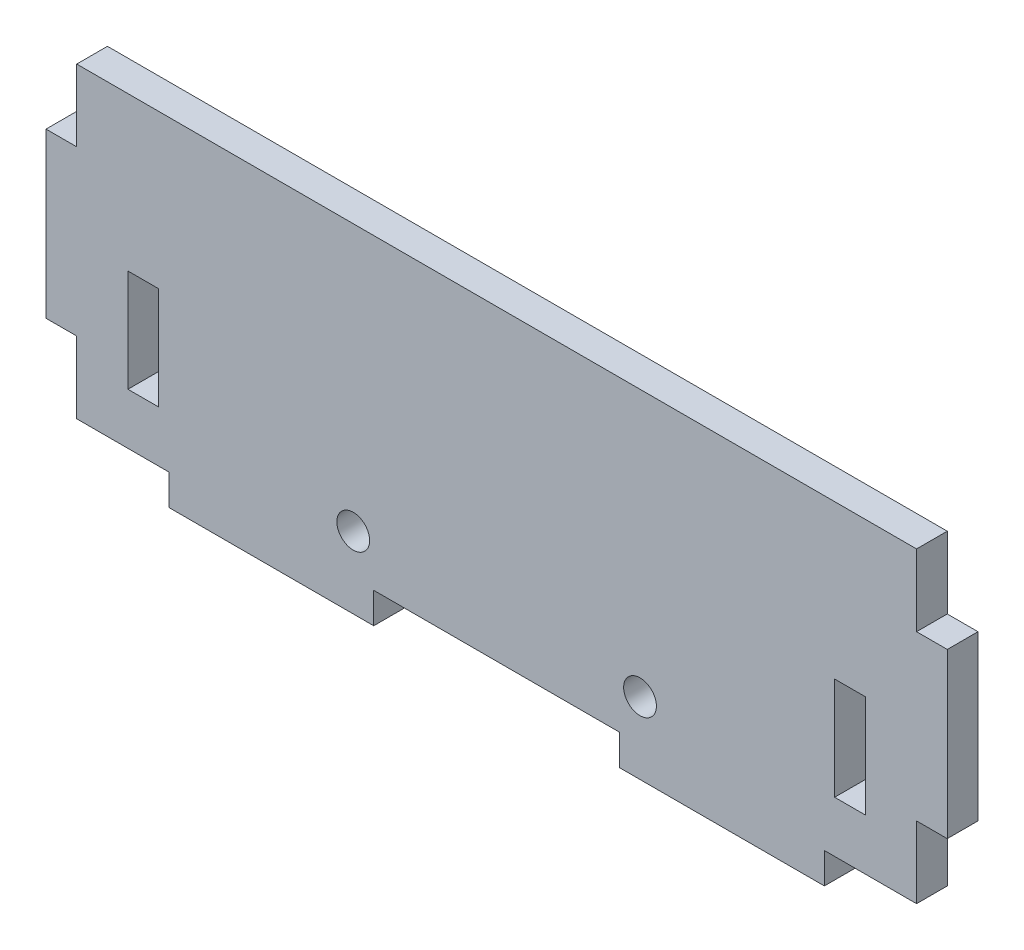
ISO-10303-21;
HEADER;
FILE_DESCRIPTION(('STEP AP214'),'2;1');
FILE_NAME('part.step','',(''),(''),'','','');
FILE_SCHEMA(('AUTOMOTIVE_DESIGN { 1 0 10303 214 1 1 1 1 }'));
ENDSEC;
DATA;
#1=APPLICATION_CONTEXT('core data for automotive mechanical design processes');
#2=APPLICATION_PROTOCOL_DEFINITION('international standard','automotive_design',2000,#1);
#3=PRODUCT_CONTEXT('',#1,'mechanical');
#4=PRODUCT('Part','Part','',(#3));
#5=PRODUCT_RELATED_PRODUCT_CATEGORY('part','',(#4));
#6=PRODUCT_DEFINITION_FORMATION('','',#4);
#7=PRODUCT_DEFINITION_CONTEXT('part definition',#1,'design');
#8=PRODUCT_DEFINITION('design','',#6,#7);
#9=PRODUCT_DEFINITION_SHAPE('','',#8);
#10=(LENGTH_UNIT() NAMED_UNIT(*) SI_UNIT(.MILLI.,.METRE.));
#11=(NAMED_UNIT(*) PLANE_ANGLE_UNIT() SI_UNIT($,.RADIAN.));
#12=(NAMED_UNIT(*) SI_UNIT($,.STERADIAN.) SOLID_ANGLE_UNIT());
#13=UNCERTAINTY_MEASURE_WITH_UNIT(LENGTH_MEASURE(1.E-05),#10,'distance_accuracy_value','');
#14=(GEOMETRIC_REPRESENTATION_CONTEXT(3) GLOBAL_UNCERTAINTY_ASSIGNED_CONTEXT((#13)) GLOBAL_UNIT_ASSIGNED_CONTEXT((#10,
#11,#12)) REPRESENTATION_CONTEXT('',''));
#15=CARTESIAN_POINT('',(0.,0.,0.));
#16=DIRECTION('',(0.,0.,1.));
#17=DIRECTION('',(1.,0.,0.));
#18=AXIS2_PLACEMENT_3D('',#15,#16,#17);
#19=CARTESIAN_POINT('',(8.,0.,3.));
#20=DIRECTION('',(1.,0.,0.));
#21=DIRECTION('',(0.,0.,-1.));
#22=AXIS2_PLACEMENT_3D('',#19,#20,#21);
#23=PLANE('',#22);
#24=DIRECTION('',(0.,-1.,0.));
#25=VECTOR('',#24,1.);
#26=CARTESIAN_POINT('',(8.,0.,0.));
#27=LINE('',#26,#25);
#28=CARTESIAN_POINT('',(8.,15.,0.));
#29=VERTEX_POINT('',#28);
#30=CARTESIAN_POINT('',(8.,5.,0.));
#31=VERTEX_POINT('',#30);
#32=EDGE_CURVE('E395',#29,#31,#27,.T.);
#33=ORIENTED_EDGE('',*,*,#32,.F.);
#34=DIRECTION('',(0.,0.,-1.));
#35=VECTOR('',#34,1.);
#36=CARTESIAN_POINT('',(8.,15.,3.));
#37=LINE('',#36,#35);
#38=CARTESIAN_POINT('',(8.,15.,3.));
#39=VERTEX_POINT('',#38);
#40=EDGE_CURVE('E11',#39,#29,#37,.T.);
#41=ORIENTED_EDGE('',*,*,#40,.F.);
#42=DIRECTION('',(0.,-1.,0.));
#43=VECTOR('',#42,1.);
#44=CARTESIAN_POINT('',(8.,0.,3.));
#45=LINE('',#44,#43);
#46=CARTESIAN_POINT('',(8.,5.,3.));
#47=VERTEX_POINT('',#46);
#48=EDGE_CURVE('E241',#39,#47,#45,.T.);
#49=ORIENTED_EDGE('',*,*,#48,.T.);
#50=DIRECTION('',(0.,0.,-1.));
#51=VECTOR('',#50,1.);
#52=CARTESIAN_POINT('',(8.,5.,3.));
#53=LINE('',#52,#51);
#54=EDGE_CURVE('E54',#47,#31,#53,.T.);
#55=ORIENTED_EDGE('',*,*,#54,.T.);
#56=EDGE_LOOP('',(#33,#41,#49,#55));
#57=FACE_BOUND('',#56,.T.);
#58=ADVANCED_FACE('F35',(#57),#23,.T.);
#59=CARTESIAN_POINT('',(0.,15.,3.));
#60=DIRECTION('',(0.,1.,0.));
#61=DIRECTION('',(0.,0.,1.));
#62=AXIS2_PLACEMENT_3D('',#59,#60,#61);
#63=PLANE('',#62);
#64=DIRECTION('',(1.,0.,0.));
#65=VECTOR('',#64,1.);
#66=CARTESIAN_POINT('',(0.,15.,0.));
#67=LINE('',#66,#65);
#68=CARTESIAN_POINT('',(11.,15.,0.));
#69=VERTEX_POINT('',#68);
#70=EDGE_CURVE('E246',#29,#69,#67,.T.);
#71=ORIENTED_EDGE('',*,*,#70,.T.);
#72=DIRECTION('',(0.,0.,-1.));
#73=VECTOR('',#72,1.);
#74=CARTESIAN_POINT('',(11.,15.,3.));
#75=LINE('',#74,#73);
#76=CARTESIAN_POINT('',(11.,15.,3.));
#77=VERTEX_POINT('',#76);
#78=EDGE_CURVE('E45',#77,#69,#75,.T.);
#79=ORIENTED_EDGE('',*,*,#78,.F.);
#80=DIRECTION('',(1.,0.,0.));
#81=VECTOR('',#80,1.);
#82=CARTESIAN_POINT('',(0.,15.,3.));
#83=LINE('',#82,#81);
#84=EDGE_CURVE('E235',#39,#77,#83,.T.);
#85=ORIENTED_EDGE('',*,*,#84,.F.);
#86=ORIENTED_EDGE('',*,*,#40,.T.);
#87=EDGE_LOOP('',(#71,#79,#85,#86));
#88=FACE_BOUND('',#87,.T.);
#89=ADVANCED_FACE('F244',(#88),#63,.F.);
#90=CARTESIAN_POINT('',(11.,0.,3.));
#91=DIRECTION('',(1.,0.,0.));
#92=DIRECTION('',(0.,0.,-1.));
#93=AXIS2_PLACEMENT_3D('',#90,#91,#92);
#94=PLANE('',#93);
#95=DIRECTION('',(0.,-1.,0.));
#96=VECTOR('',#95,1.);
#97=CARTESIAN_POINT('',(11.,0.,0.));
#98=LINE('',#97,#96);
#99=CARTESIAN_POINT('',(11.,5.,0.));
#100=VERTEX_POINT('',#99);
#101=EDGE_CURVE('E398',#69,#100,#98,.T.);
#102=ORIENTED_EDGE('',*,*,#101,.T.);
#103=DIRECTION('',(0.,0.,-1.));
#104=VECTOR('',#103,1.);
#105=CARTESIAN_POINT('',(11.,5.,3.));
#106=LINE('',#105,#104);
#107=CARTESIAN_POINT('',(11.,5.,3.));
#108=VERTEX_POINT('',#107);
#109=EDGE_CURVE('E140',#108,#100,#106,.T.);
#110=ORIENTED_EDGE('',*,*,#109,.F.);
#111=DIRECTION('',(0.,-1.,0.));
#112=VECTOR('',#111,1.);
#113=CARTESIAN_POINT('',(11.,0.,3.));
#114=LINE('',#113,#112);
#115=EDGE_CURVE('E227',#77,#108,#114,.T.);
#116=ORIENTED_EDGE('',*,*,#115,.F.);
#117=ORIENTED_EDGE('',*,*,#78,.T.);
#118=EDGE_LOOP('',(#102,#110,#116,#117));
#119=FACE_BOUND('',#118,.T.);
#120=ADVANCED_FACE('F229',(#119),#94,.F.);
#121=CARTESIAN_POINT('',(3.,0.,3.));
#122=DIRECTION('',(-1.,0.,0.));
#123=DIRECTION('',(0.,0.,1.));
#124=AXIS2_PLACEMENT_3D('',#121,#122,#123);
#125=PLANE('',#124);
#126=DIRECTION('',(0.,1.,0.));
#127=VECTOR('',#126,1.);
#128=CARTESIAN_POINT('',(3.,0.,0.));
#129=LINE('',#128,#127);
#130=CARTESIAN_POINT('',(3.,23.,0.));
#131=VERTEX_POINT('',#130);
#132=CARTESIAN_POINT('',(3.,30.,0.));
#133=VERTEX_POINT('',#132);
#134=EDGE_CURVE('E335',#131,#133,#129,.T.);
#135=ORIENTED_EDGE('',*,*,#134,.F.);
#136=DIRECTION('',(0.,0.,-1.));
#137=VECTOR('',#136,1.);
#138=CARTESIAN_POINT('',(3.,23.,3.));
#139=LINE('',#138,#137);
#140=CARTESIAN_POINT('',(3.,23.,3.));
#141=VERTEX_POINT('',#140);
#142=EDGE_CURVE('E297',#141,#131,#139,.T.);
#143=ORIENTED_EDGE('',*,*,#142,.F.);
#144=DIRECTION('',(0.,1.,0.));
#145=VECTOR('',#144,1.);
#146=CARTESIAN_POINT('',(3.,0.,3.));
#147=LINE('',#146,#145);
#148=CARTESIAN_POINT('',(3.,30.,3.));
#149=VERTEX_POINT('',#148);
#150=EDGE_CURVE('E421',#141,#149,#147,.T.);
#151=ORIENTED_EDGE('',*,*,#150,.T.);
#152=DIRECTION('',(0.,0.,-1.));
#153=VECTOR('',#152,1.);
#154=CARTESIAN_POINT('',(3.,30.,3.));
#155=LINE('',#154,#153);
#156=EDGE_CURVE('E251',#149,#133,#155,.T.);
#157=ORIENTED_EDGE('',*,*,#156,.T.);
#158=EDGE_LOOP('',(#135,#143,#151,#157));
#159=FACE_BOUND('',#158,.T.);
#160=ADVANCED_FACE('F581',(#159),#125,.T.);
#161=CARTESIAN_POINT('',(0.,23.,3.));
#162=DIRECTION('',(0.,1.,0.));
#163=DIRECTION('',(0.,0.,1.));
#164=AXIS2_PLACEMENT_3D('',#161,#162,#163);
#165=PLANE('',#164);
#166=DIRECTION('',(1.,0.,0.));
#167=VECTOR('',#166,1.);
#168=CARTESIAN_POINT('',(0.,23.,0.));
#169=LINE('',#168,#167);
#170=CARTESIAN_POINT('',(0.,23.,0.));
#171=VERTEX_POINT('',#170);
#172=EDGE_CURVE('E338',#171,#131,#169,.T.);
#173=ORIENTED_EDGE('',*,*,#172,.F.);
#174=DIRECTION('',(0.,0.,-1.));
#175=VECTOR('',#174,1.);
#176=CARTESIAN_POINT('',(0.,23.,3.));
#177=LINE('',#176,#175);
#178=CARTESIAN_POINT('',(0.,23.,3.));
#179=VERTEX_POINT('',#178);
#180=EDGE_CURVE('E295',#179,#171,#177,.T.);
#181=ORIENTED_EDGE('',*,*,#180,.F.);
#182=DIRECTION('',(1.,0.,0.));
#183=VECTOR('',#182,1.);
#184=CARTESIAN_POINT('',(0.,23.,3.));
#185=LINE('',#184,#183);
#186=EDGE_CURVE('E424',#179,#141,#185,.T.);
#187=ORIENTED_EDGE('',*,*,#186,.T.);
#188=ORIENTED_EDGE('',*,*,#142,.T.);
#189=EDGE_LOOP('',(#173,#181,#187,#188));
#190=FACE_BOUND('',#189,.T.);
#191=ADVANCED_FACE('F577',(#190),#165,.T.);
#192=CARTESIAN_POINT('',(0.,0.,3.));
#193=DIRECTION('',(-1.,0.,0.));
#194=DIRECTION('',(0.,0.,1.));
#195=AXIS2_PLACEMENT_3D('',#192,#193,#194);
#196=PLANE('',#195);
#197=DIRECTION('',(0.,1.,0.));
#198=VECTOR('',#197,1.);
#199=CARTESIAN_POINT('',(0.,0.,0.));
#200=LINE('',#199,#198);
#201=CARTESIAN_POINT('',(0.,7.,0.));
#202=VERTEX_POINT('',#201);
#203=EDGE_CURVE('E341',#202,#171,#200,.T.);
#204=ORIENTED_EDGE('',*,*,#203,.F.);
#205=DIRECTION('',(0.,0.,-1.));
#206=VECTOR('',#205,1.);
#207=CARTESIAN_POINT('',(0.,7.,3.));
#208=LINE('',#207,#206);
#209=CARTESIAN_POINT('',(0.,7.,3.));
#210=VERTEX_POINT('',#209);
#211=EDGE_CURVE('E293',#210,#202,#208,.T.);
#212=ORIENTED_EDGE('',*,*,#211,.F.);
#213=DIRECTION('',(0.,1.,0.));
#214=VECTOR('',#213,1.);
#215=CARTESIAN_POINT('',(0.,0.,3.));
#216=LINE('',#215,#214);
#217=EDGE_CURVE('E427',#210,#179,#216,.T.);
#218=ORIENTED_EDGE('',*,*,#217,.T.);
#219=ORIENTED_EDGE('',*,*,#180,.T.);
#220=EDGE_LOOP('',(#204,#212,#218,#219));
#221=FACE_BOUND('',#220,.T.);
#222=ADVANCED_FACE('F573',(#221),#196,.T.);
#223=CARTESIAN_POINT('',(0.,7.,3.));
#224=DIRECTION('',(0.,-1.,0.));
#225=DIRECTION('',(0.,0.,-1.));
#226=AXIS2_PLACEMENT_3D('',#223,#224,#225);
#227=PLANE('',#226);
#228=DIRECTION('',(-1.,0.,0.));
#229=VECTOR('',#228,1.);
#230=CARTESIAN_POINT('',(0.,7.,0.));
#231=LINE('',#230,#229);
#232=CARTESIAN_POINT('',(3.,7.,0.));
#233=VERTEX_POINT('',#232);
#234=EDGE_CURVE('E344',#233,#202,#231,.T.);
#235=ORIENTED_EDGE('',*,*,#234,.F.);
#236=DIRECTION('',(0.,0.,-1.));
#237=VECTOR('',#236,1.);
#238=CARTESIAN_POINT('',(3.,7.,3.));
#239=LINE('',#238,#237);
#240=CARTESIAN_POINT('',(3.,7.,3.));
#241=VERTEX_POINT('',#240);
#242=EDGE_CURVE('E291',#241,#233,#239,.T.);
#243=ORIENTED_EDGE('',*,*,#242,.F.);
#244=DIRECTION('',(-1.,0.,0.));
#245=VECTOR('',#244,1.);
#246=CARTESIAN_POINT('',(0.,7.,3.));
#247=LINE('',#246,#245);
#248=EDGE_CURVE('E430',#241,#210,#247,.T.);
#249=ORIENTED_EDGE('',*,*,#248,.T.);
#250=ORIENTED_EDGE('',*,*,#211,.T.);
#251=EDGE_LOOP('',(#235,#243,#249,#250));
#252=FACE_BOUND('',#251,.T.);
#253=ADVANCED_FACE('F569',(#252),#227,.T.);
#254=CARTESIAN_POINT('',(3.,0.,3.));
#255=DIRECTION('',(-1.,0.,0.));
#256=DIRECTION('',(0.,0.,1.));
#257=AXIS2_PLACEMENT_3D('',#254,#255,#256);
#258=PLANE('',#257);
#259=DIRECTION('',(0.,1.,0.));
#260=VECTOR('',#259,1.);
#261=CARTESIAN_POINT('',(3.,0.,0.));
#262=LINE('',#261,#260);
#263=CARTESIAN_POINT('',(3.,0.,0.));
#264=VERTEX_POINT('',#263);
#265=EDGE_CURVE('E347',#264,#233,#262,.T.);
#266=ORIENTED_EDGE('',*,*,#265,.F.);
#267=DIRECTION('',(0.,0.,-1.));
#268=VECTOR('',#267,1.);
#269=CARTESIAN_POINT('',(3.,0.,3.));
#270=LINE('',#269,#268);
#271=CARTESIAN_POINT('',(3.,0.,3.));
#272=VERTEX_POINT('',#271);
#273=EDGE_CURVE('E289',#272,#264,#270,.T.);
#274=ORIENTED_EDGE('',*,*,#273,.F.);
#275=DIRECTION('',(0.,1.,0.));
#276=VECTOR('',#275,1.);
#277=CARTESIAN_POINT('',(3.,0.,3.));
#278=LINE('',#277,#276);
#279=EDGE_CURVE('E433',#272,#241,#278,.T.);
#280=ORIENTED_EDGE('',*,*,#279,.T.);
#281=ORIENTED_EDGE('',*,*,#242,.T.);
#282=EDGE_LOOP('',(#266,#274,#280,#281));
#283=FACE_BOUND('',#282,.T.);
#284=ADVANCED_FACE('F565',(#283),#258,.T.);
#285=CARTESIAN_POINT('',(0.,0.,3.));
#286=DIRECTION('',(0.,1.,0.));
#287=DIRECTION('',(0.,0.,1.));
#288=AXIS2_PLACEMENT_3D('',#285,#286,#287);
#289=PLANE('',#288);
#290=DIRECTION('',(1.,0.,0.));
#291=VECTOR('',#290,1.);
#292=CARTESIAN_POINT('',(0.,0.,0.));
#293=LINE('',#292,#291);
#294=CARTESIAN_POINT('',(12.,0.,0.));
#295=VERTEX_POINT('',#294);
#296=EDGE_CURVE('E350',#264,#295,#293,.T.);
#297=ORIENTED_EDGE('',*,*,#296,.T.);
#298=DIRECTION('',(0.,0.,-1.));
#299=VECTOR('',#298,1.);
#300=CARTESIAN_POINT('',(12.,0.,3.));
#301=LINE('',#300,#299);
#302=CARTESIAN_POINT('',(12.,0.,3.));
#303=VERTEX_POINT('',#302);
#304=EDGE_CURVE('E286',#303,#295,#301,.T.);
#305=ORIENTED_EDGE('',*,*,#304,.F.);
#306=DIRECTION('',(1.,0.,0.));
#307=VECTOR('',#306,1.);
#308=CARTESIAN_POINT('',(0.,0.,3.));
#309=LINE('',#308,#307);
#310=EDGE_CURVE('E436',#272,#303,#309,.T.);
#311=ORIENTED_EDGE('',*,*,#310,.F.);
#312=ORIENTED_EDGE('',*,*,#273,.T.);
#313=EDGE_LOOP('',(#297,#305,#311,#312));
#314=FACE_BOUND('',#313,.T.);
#315=ADVANCED_FACE('F561',(#314),#289,.F.);
#316=CARTESIAN_POINT('',(12.,0.,3.));
#317=DIRECTION('',(1.,0.,0.));
#318=DIRECTION('',(0.,0.,-1.));
#319=AXIS2_PLACEMENT_3D('',#316,#317,#318);
#320=PLANE('',#319);
#321=DIRECTION('',(0.,-1.,0.));
#322=VECTOR('',#321,1.);
#323=CARTESIAN_POINT('',(12.,0.,0.));
#324=LINE('',#323,#322);
#325=CARTESIAN_POINT('',(12.,-3.,0.));
#326=VERTEX_POINT('',#325);
#327=EDGE_CURVE('E353',#295,#326,#324,.T.);
#328=ORIENTED_EDGE('',*,*,#327,.T.);
#329=DIRECTION('',(0.,0.,-1.));
#330=VECTOR('',#329,1.);
#331=CARTESIAN_POINT('',(12.,-3.,3.));
#332=LINE('',#331,#330);
#333=CARTESIAN_POINT('',(12.,-3.,3.));
#334=VERTEX_POINT('',#333);
#335=EDGE_CURVE('E283',#334,#326,#332,.T.);
#336=ORIENTED_EDGE('',*,*,#335,.F.);
#337=DIRECTION('',(0.,-1.,0.));
#338=VECTOR('',#337,1.);
#339=CARTESIAN_POINT('',(12.,0.,3.));
#340=LINE('',#339,#338);
#341=EDGE_CURVE('E439',#303,#334,#340,.T.);
#342=ORIENTED_EDGE('',*,*,#341,.F.);
#343=ORIENTED_EDGE('',*,*,#304,.T.);
#344=EDGE_LOOP('',(#328,#336,#342,#343));
#345=FACE_BOUND('',#344,.T.);
#346=ADVANCED_FACE('F557',(#345),#320,.F.);
#347=CARTESIAN_POINT('',(0.,-3.,3.));
#348=DIRECTION('',(0.,1.,0.));
#349=DIRECTION('',(0.,0.,1.));
#350=AXIS2_PLACEMENT_3D('',#347,#348,#349);
#351=PLANE('',#350);
#352=DIRECTION('',(1.,0.,0.));
#353=VECTOR('',#352,1.);
#354=CARTESIAN_POINT('',(0.,-3.,0.));
#355=LINE('',#354,#353);
#356=CARTESIAN_POINT('',(32.,-3.,0.));
#357=VERTEX_POINT('',#356);
#358=EDGE_CURVE('E356',#326,#357,#355,.T.);
#359=ORIENTED_EDGE('',*,*,#358,.T.);
#360=DIRECTION('',(0.,0.,-1.));
#361=VECTOR('',#360,1.);
#362=CARTESIAN_POINT('',(32.,-3.,3.));
#363=LINE('',#362,#361);
#364=CARTESIAN_POINT('',(32.,-3.,3.));
#365=VERTEX_POINT('',#364);
#366=EDGE_CURVE('E280',#365,#357,#363,.T.);
#367=ORIENTED_EDGE('',*,*,#366,.F.);
#368=DIRECTION('',(1.,0.,0.));
#369=VECTOR('',#368,1.);
#370=CARTESIAN_POINT('',(0.,-3.,3.));
#371=LINE('',#370,#369);
#372=EDGE_CURVE('E442',#334,#365,#371,.T.);
#373=ORIENTED_EDGE('',*,*,#372,.F.);
#374=ORIENTED_EDGE('',*,*,#335,.T.);
#375=EDGE_LOOP('',(#359,#367,#373,#374));
#376=FACE_BOUND('',#375,.T.);
#377=ADVANCED_FACE('F553',(#376),#351,.F.);
#378=CARTESIAN_POINT('',(32.,0.,3.));
#379=DIRECTION('',(-1.,0.,0.));
#380=DIRECTION('',(0.,0.,1.));
#381=AXIS2_PLACEMENT_3D('',#378,#379,#380);
#382=PLANE('',#381);
#383=DIRECTION('',(0.,1.,0.));
#384=VECTOR('',#383,1.);
#385=CARTESIAN_POINT('',(32.,0.,0.));
#386=LINE('',#385,#384);
#387=CARTESIAN_POINT('',(32.,0.,0.));
#388=VERTEX_POINT('',#387);
#389=EDGE_CURVE('E359',#357,#388,#386,.T.);
#390=ORIENTED_EDGE('',*,*,#389,.T.);
#391=DIRECTION('',(0.,0.,-1.));
#392=VECTOR('',#391,1.);
#393=CARTESIAN_POINT('',(32.,0.,3.));
#394=LINE('',#393,#392);
#395=CARTESIAN_POINT('',(32.,0.,3.));
#396=VERTEX_POINT('',#395);
#397=EDGE_CURVE('E277',#396,#388,#394,.T.);
#398=ORIENTED_EDGE('',*,*,#397,.F.);
#399=DIRECTION('',(0.,1.,0.));
#400=VECTOR('',#399,1.);
#401=CARTESIAN_POINT('',(32.,0.,3.));
#402=LINE('',#401,#400);
#403=EDGE_CURVE('E445',#365,#396,#402,.T.);
#404=ORIENTED_EDGE('',*,*,#403,.F.);
#405=ORIENTED_EDGE('',*,*,#366,.T.);
#406=EDGE_LOOP('',(#390,#398,#404,#405));
#407=FACE_BOUND('',#406,.T.);
#408=ADVANCED_FACE('F549',(#407),#382,.F.);
#409=CARTESIAN_POINT('',(0.,0.,3.));
#410=DIRECTION('',(0.,1.,0.));
#411=DIRECTION('',(0.,0.,1.));
#412=AXIS2_PLACEMENT_3D('',#409,#410,#411);
#413=PLANE('',#412);
#414=DIRECTION('',(1.,0.,0.));
#415=VECTOR('',#414,1.);
#416=CARTESIAN_POINT('',(0.,0.,0.));
#417=LINE('',#416,#415);
#418=CARTESIAN_POINT('',(56.,0.,0.));
#419=VERTEX_POINT('',#418);
#420=EDGE_CURVE('E362',#388,#419,#417,.T.);
#421=ORIENTED_EDGE('',*,*,#420,.T.);
#422=DIRECTION('',(0.,0.,-1.));
#423=VECTOR('',#422,1.);
#424=CARTESIAN_POINT('',(56.,0.,3.));
#425=LINE('',#424,#423);
#426=CARTESIAN_POINT('',(56.,0.,3.));
#427=VERTEX_POINT('',#426);
#428=EDGE_CURVE('E275',#427,#419,#425,.T.);
#429=ORIENTED_EDGE('',*,*,#428,.F.);
#430=DIRECTION('',(1.,0.,0.));
#431=VECTOR('',#430,1.);
#432=CARTESIAN_POINT('',(0.,0.,3.));
#433=LINE('',#432,#431);
#434=EDGE_CURVE('E448',#396,#427,#433,.T.);
#435=ORIENTED_EDGE('',*,*,#434,.F.);
#436=ORIENTED_EDGE('',*,*,#397,.T.);
#437=EDGE_LOOP('',(#421,#429,#435,#436));
#438=FACE_BOUND('',#437,.T.);
#439=ADVANCED_FACE('F545',(#438),#413,.F.);
#440=CARTESIAN_POINT('',(56.,0.,3.));
#441=DIRECTION('',(-1.,0.,0.));
#442=DIRECTION('',(0.,0.,1.));
#443=AXIS2_PLACEMENT_3D('',#440,#441,#442);
#444=PLANE('',#443);
#445=DIRECTION('',(0.,1.,0.));
#446=VECTOR('',#445,1.);
#447=CARTESIAN_POINT('',(56.,0.,0.));
#448=LINE('',#447,#446);
#449=CARTESIAN_POINT('',(56.,-3.,0.));
#450=VERTEX_POINT('',#449);
#451=EDGE_CURVE('E365',#450,#419,#448,.T.);
#452=ORIENTED_EDGE('',*,*,#451,.F.);
#453=DIRECTION('',(0.,0.,-1.));
#454=VECTOR('',#453,1.);
#455=CARTESIAN_POINT('',(56.,-3.,3.));
#456=LINE('',#455,#454);
#457=CARTESIAN_POINT('',(56.,-3.,3.));
#458=VERTEX_POINT('',#457);
#459=EDGE_CURVE('E273',#458,#450,#456,.T.);
#460=ORIENTED_EDGE('',*,*,#459,.F.);
#461=DIRECTION('',(0.,1.,0.));
#462=VECTOR('',#461,1.);
#463=CARTESIAN_POINT('',(56.,0.,3.));
#464=LINE('',#463,#462);
#465=EDGE_CURVE('E450',#458,#427,#464,.T.);
#466=ORIENTED_EDGE('',*,*,#465,.T.);
#467=ORIENTED_EDGE('',*,*,#428,.T.);
#468=EDGE_LOOP('',(#452,#460,#466,#467));
#469=FACE_BOUND('',#468,.T.);
#470=ADVANCED_FACE('F541',(#469),#444,.T.);
#471=CARTESIAN_POINT('',(0.,-3.,3.));
#472=DIRECTION('',(0.,-1.,0.));
#473=DIRECTION('',(0.,0.,-1.));
#474=AXIS2_PLACEMENT_3D('',#471,#472,#473);
#475=PLANE('',#474);
#476=DIRECTION('',(-1.,0.,0.));
#477=VECTOR('',#476,1.);
#478=CARTESIAN_POINT('',(0.,-3.,0.));
#479=LINE('',#478,#477);
#480=CARTESIAN_POINT('',(76.,-3.,0.));
#481=VERTEX_POINT('',#480);
#482=EDGE_CURVE('E368',#481,#450,#479,.T.);
#483=ORIENTED_EDGE('',*,*,#482,.F.);
#484=DIRECTION('',(0.,0.,-1.));
#485=VECTOR('',#484,1.);
#486=CARTESIAN_POINT('',(76.,-3.,3.));
#487=LINE('',#486,#485);
#488=CARTESIAN_POINT('',(76.,-3.,3.));
#489=VERTEX_POINT('',#488);
#490=EDGE_CURVE('E271',#489,#481,#487,.T.);
#491=ORIENTED_EDGE('',*,*,#490,.F.);
#492=DIRECTION('',(-1.,0.,0.));
#493=VECTOR('',#492,1.);
#494=CARTESIAN_POINT('',(0.,-3.,3.));
#495=LINE('',#494,#493);
#496=EDGE_CURVE('E453',#489,#458,#495,.T.);
#497=ORIENTED_EDGE('',*,*,#496,.T.);
#498=ORIENTED_EDGE('',*,*,#459,.T.);
#499=EDGE_LOOP('',(#483,#491,#497,#498));
#500=FACE_BOUND('',#499,.T.);
#501=ADVANCED_FACE('F537',(#500),#475,.T.);
#502=CARTESIAN_POINT('',(76.,0.,3.));
#503=DIRECTION('',(1.,0.,0.));
#504=DIRECTION('',(0.,0.,-1.));
#505=AXIS2_PLACEMENT_3D('',#502,#503,#504);
#506=PLANE('',#505);
#507=DIRECTION('',(0.,-1.,0.));
#508=VECTOR('',#507,1.);
#509=CARTESIAN_POINT('',(76.,0.,0.));
#510=LINE('',#509,#508);
#511=CARTESIAN_POINT('',(76.,0.,0.));
#512=VERTEX_POINT('',#511);
#513=EDGE_CURVE('E371',#512,#481,#510,.T.);
#514=ORIENTED_EDGE('',*,*,#513,.F.);
#515=DIRECTION('',(0.,0.,-1.));
#516=VECTOR('',#515,1.);
#517=CARTESIAN_POINT('',(76.,0.,3.));
#518=LINE('',#517,#516);
#519=CARTESIAN_POINT('',(76.,0.,3.));
#520=VERTEX_POINT('',#519);
#521=EDGE_CURVE('E269',#520,#512,#518,.T.);
#522=ORIENTED_EDGE('',*,*,#521,.F.);
#523=DIRECTION('',(0.,-1.,0.));
#524=VECTOR('',#523,1.);
#525=CARTESIAN_POINT('',(76.,0.,3.));
#526=LINE('',#525,#524);
#527=EDGE_CURVE('E456',#520,#489,#526,.T.);
#528=ORIENTED_EDGE('',*,*,#527,.T.);
#529=ORIENTED_EDGE('',*,*,#490,.T.);
#530=EDGE_LOOP('',(#514,#522,#528,#529));
#531=FACE_BOUND('',#530,.T.);
#532=ADVANCED_FACE('F533',(#531),#506,.T.);
#533=CARTESIAN_POINT('',(0.,0.,3.));
#534=DIRECTION('',(0.,-1.,0.));
#535=DIRECTION('',(0.,0.,-1.));
#536=AXIS2_PLACEMENT_3D('',#533,#534,#535);
#537=PLANE('',#536);
#538=DIRECTION('',(-1.,0.,0.));
#539=VECTOR('',#538,1.);
#540=CARTESIAN_POINT('',(0.,0.,0.));
#541=LINE('',#540,#539);
#542=CARTESIAN_POINT('',(85.,0.,0.));
#543=VERTEX_POINT('',#542);
#544=EDGE_CURVE('E374',#543,#512,#541,.T.);
#545=ORIENTED_EDGE('',*,*,#544,.F.);
#546=DIRECTION('',(0.,0.,-1.));
#547=VECTOR('',#546,1.);
#548=CARTESIAN_POINT('',(85.,0.,3.));
#549=LINE('',#548,#547);
#550=CARTESIAN_POINT('',(85.,0.,3.));
#551=VERTEX_POINT('',#550);
#552=EDGE_CURVE('E267',#551,#543,#549,.T.);
#553=ORIENTED_EDGE('',*,*,#552,.F.);
#554=DIRECTION('',(-1.,0.,0.));
#555=VECTOR('',#554,1.);
#556=CARTESIAN_POINT('',(0.,0.,3.));
#557=LINE('',#556,#555);
#558=EDGE_CURVE('E459',#551,#520,#557,.T.);
#559=ORIENTED_EDGE('',*,*,#558,.T.);
#560=ORIENTED_EDGE('',*,*,#521,.T.);
#561=EDGE_LOOP('',(#545,#553,#559,#560));
#562=FACE_BOUND('',#561,.T.);
#563=ADVANCED_FACE('F529',(#562),#537,.T.);
#564=CARTESIAN_POINT('',(85.,0.,3.));
#565=DIRECTION('',(-1.,0.,0.));
#566=DIRECTION('',(0.,0.,1.));
#567=AXIS2_PLACEMENT_3D('',#564,#565,#566);
#568=PLANE('',#567);
#569=DIRECTION('',(0.,1.,0.));
#570=VECTOR('',#569,1.);
#571=CARTESIAN_POINT('',(85.,0.,0.));
#572=LINE('',#571,#570);
#573=CARTESIAN_POINT('',(85.,7.,0.));
#574=VERTEX_POINT('',#573);
#575=EDGE_CURVE('E377',#543,#574,#572,.T.);
#576=ORIENTED_EDGE('',*,*,#575,.T.);
#577=DIRECTION('',(0.,0.,-1.));
#578=VECTOR('',#577,1.);
#579=CARTESIAN_POINT('',(85.,7.,3.));
#580=LINE('',#579,#578);
#581=CARTESIAN_POINT('',(85.,7.,3.));
#582=VERTEX_POINT('',#581);
#583=EDGE_CURVE('E264',#582,#574,#580,.T.);
#584=ORIENTED_EDGE('',*,*,#583,.F.);
#585=DIRECTION('',(0.,1.,0.));
#586=VECTOR('',#585,1.);
#587=CARTESIAN_POINT('',(85.,0.,3.));
#588=LINE('',#587,#586);
#589=EDGE_CURVE('E462',#551,#582,#588,.T.);
#590=ORIENTED_EDGE('',*,*,#589,.F.);
#591=ORIENTED_EDGE('',*,*,#552,.T.);
#592=EDGE_LOOP('',(#576,#584,#590,#591));
#593=FACE_BOUND('',#592,.T.);
#594=ADVANCED_FACE('F525',(#593),#568,.F.);
#595=CARTESIAN_POINT('',(0.,7.,3.));
#596=DIRECTION('',(0.,1.,0.));
#597=DIRECTION('',(0.,0.,1.));
#598=AXIS2_PLACEMENT_3D('',#595,#596,#597);
#599=PLANE('',#598);
#600=DIRECTION('',(1.,0.,0.));
#601=VECTOR('',#600,1.);
#602=CARTESIAN_POINT('',(0.,7.,0.));
#603=LINE('',#602,#601);
#604=CARTESIAN_POINT('',(88.,7.,0.));
#605=VERTEX_POINT('',#604);
#606=EDGE_CURVE('E380',#574,#605,#603,.T.);
#607=ORIENTED_EDGE('',*,*,#606,.T.);
#608=DIRECTION('',(0.,0.,-1.));
#609=VECTOR('',#608,1.);
#610=CARTESIAN_POINT('',(88.,7.,3.));
#611=LINE('',#610,#609);
#612=CARTESIAN_POINT('',(88.,7.,3.));
#613=VERTEX_POINT('',#612);
#614=EDGE_CURVE('E261',#613,#605,#611,.T.);
#615=ORIENTED_EDGE('',*,*,#614,.F.);
#616=DIRECTION('',(1.,0.,0.));
#617=VECTOR('',#616,1.);
#618=CARTESIAN_POINT('',(0.,7.,3.));
#619=LINE('',#618,#617);
#620=EDGE_CURVE('E465',#582,#613,#619,.T.);
#621=ORIENTED_EDGE('',*,*,#620,.F.);
#622=ORIENTED_EDGE('',*,*,#583,.T.);
#623=EDGE_LOOP('',(#607,#615,#621,#622));
#624=FACE_BOUND('',#623,.T.);
#625=ADVANCED_FACE('F521',(#624),#599,.F.);
#626=CARTESIAN_POINT('',(88.,0.,3.));
#627=DIRECTION('',(-1.,0.,0.));
#628=DIRECTION('',(0.,0.,1.));
#629=AXIS2_PLACEMENT_3D('',#626,#627,#628);
#630=PLANE('',#629);
#631=DIRECTION('',(0.,1.,0.));
#632=VECTOR('',#631,1.);
#633=CARTESIAN_POINT('',(88.,0.,0.));
#634=LINE('',#633,#632);
#635=CARTESIAN_POINT('',(88.,23.,0.));
#636=VERTEX_POINT('',#635);
#637=EDGE_CURVE('E383',#605,#636,#634,.T.);
#638=ORIENTED_EDGE('',*,*,#637,.T.);
#639=DIRECTION('',(0.,0.,-1.));
#640=VECTOR('',#639,1.);
#641=CARTESIAN_POINT('',(88.,23.,3.));
#642=LINE('',#641,#640);
#643=CARTESIAN_POINT('',(88.,23.,3.));
#644=VERTEX_POINT('',#643);
#645=EDGE_CURVE('E258',#644,#636,#642,.T.);
#646=ORIENTED_EDGE('',*,*,#645,.F.);
#647=DIRECTION('',(0.,1.,0.));
#648=VECTOR('',#647,1.);
#649=CARTESIAN_POINT('',(88.,0.,3.));
#650=LINE('',#649,#648);
#651=EDGE_CURVE('E468',#613,#644,#650,.T.);
#652=ORIENTED_EDGE('',*,*,#651,.F.);
#653=ORIENTED_EDGE('',*,*,#614,.T.);
#654=EDGE_LOOP('',(#638,#646,#652,#653));
#655=FACE_BOUND('',#654,.T.);
#656=ADVANCED_FACE('F517',(#655),#630,.F.);
#657=CARTESIAN_POINT('',(0.,23.,3.));
#658=DIRECTION('',(0.,-1.,0.));
#659=DIRECTION('',(0.,0.,-1.));
#660=AXIS2_PLACEMENT_3D('',#657,#658,#659);
#661=PLANE('',#660);
#662=DIRECTION('',(-1.,0.,0.));
#663=VECTOR('',#662,1.);
#664=CARTESIAN_POINT('',(0.,23.,0.));
#665=LINE('',#664,#663);
#666=CARTESIAN_POINT('',(85.,23.,0.));
#667=VERTEX_POINT('',#666);
#668=EDGE_CURVE('E386',#636,#667,#665,.T.);
#669=ORIENTED_EDGE('',*,*,#668,.T.);
#670=DIRECTION('',(0.,0.,-1.));
#671=VECTOR('',#670,1.);
#672=CARTESIAN_POINT('',(85.,23.,3.));
#673=LINE('',#672,#671);
#674=CARTESIAN_POINT('',(85.,23.,3.));
#675=VERTEX_POINT('',#674);
#676=EDGE_CURVE('E255',#675,#667,#673,.T.);
#677=ORIENTED_EDGE('',*,*,#676,.F.);
#678=DIRECTION('',(-1.,0.,0.));
#679=VECTOR('',#678,1.);
#680=CARTESIAN_POINT('',(0.,23.,3.));
#681=LINE('',#680,#679);
#682=EDGE_CURVE('E471',#644,#675,#681,.T.);
#683=ORIENTED_EDGE('',*,*,#682,.F.);
#684=ORIENTED_EDGE('',*,*,#645,.T.);
#685=EDGE_LOOP('',(#669,#677,#683,#684));
#686=FACE_BOUND('',#685,.T.);
#687=ADVANCED_FACE('F513',(#686),#661,.F.);
#688=CARTESIAN_POINT('',(85.,0.,3.));
#689=DIRECTION('',(-1.,0.,0.));
#690=DIRECTION('',(0.,0.,1.));
#691=AXIS2_PLACEMENT_3D('',#688,#689,#690);
#692=PLANE('',#691);
#693=DIRECTION('',(0.,1.,0.));
#694=VECTOR('',#693,1.);
#695=CARTESIAN_POINT('',(85.,0.,0.));
#696=LINE('',#695,#694);
#697=CARTESIAN_POINT('',(85.,30.,0.));
#698=VERTEX_POINT('',#697);
#699=EDGE_CURVE('E389',#667,#698,#696,.T.);
#700=ORIENTED_EDGE('',*,*,#699,.T.);
#701=DIRECTION('',(0.,0.,-1.));
#702=VECTOR('',#701,1.);
#703=CARTESIAN_POINT('',(85.,30.,3.));
#704=LINE('',#703,#702);
#705=CARTESIAN_POINT('',(85.,30.,3.));
#706=VERTEX_POINT('',#705);
#707=EDGE_CURVE('E253',#706,#698,#704,.T.);
#708=ORIENTED_EDGE('',*,*,#707,.F.);
#709=DIRECTION('',(0.,1.,0.));
#710=VECTOR('',#709,1.);
#711=CARTESIAN_POINT('',(85.,0.,3.));
#712=LINE('',#711,#710);
#713=EDGE_CURVE('E474',#675,#706,#712,.T.);
#714=ORIENTED_EDGE('',*,*,#713,.F.);
#715=ORIENTED_EDGE('',*,*,#676,.T.);
#716=EDGE_LOOP('',(#700,#708,#714,#715));
#717=FACE_BOUND('',#716,.T.);
#718=ADVANCED_FACE('F510',(#717),#692,.F.);
#719=CARTESIAN_POINT('',(0.,15.,3.));
#720=DIRECTION('',(0.,-1.,0.));
#721=DIRECTION('',(0.,0.,-1.));
#722=AXIS2_PLACEMENT_3D('',#719,#720,#721);
#723=PLANE('',#722);
#724=DIRECTION('',(-1.,0.,0.));
#725=VECTOR('',#724,1.);
#726=CARTESIAN_POINT('',(0.,15.,0.));
#727=LINE('',#726,#725);
#728=CARTESIAN_POINT('',(80.,15.,0.));
#729=VERTEX_POINT('',#728);
#730=CARTESIAN_POINT('',(77.,15.,0.));
#731=VERTEX_POINT('',#730);
#732=EDGE_CURVE('E321',#729,#731,#727,.T.);
#733=ORIENTED_EDGE('',*,*,#732,.F.);
#734=DIRECTION('',(0.,0.,-1.));
#735=VECTOR('',#734,1.);
#736=CARTESIAN_POINT('',(80.,15.,3.));
#737=LINE('',#736,#735);
#738=CARTESIAN_POINT('',(80.,15.,3.));
#739=VERTEX_POINT('',#738);
#740=EDGE_CURVE('E39',#739,#729,#737,.T.);
#741=ORIENTED_EDGE('',*,*,#740,.F.);
#742=DIRECTION('',(-1.,0.,0.));
#743=VECTOR('',#742,1.);
#744=CARTESIAN_POINT('',(0.,15.,3.));
#745=LINE('',#744,#743);
#746=CARTESIAN_POINT('',(77.,15.,3.));
#747=VERTEX_POINT('',#746);
#748=EDGE_CURVE('E409',#739,#747,#745,.T.);
#749=ORIENTED_EDGE('',*,*,#748,.T.);
#750=DIRECTION('',(0.,0.,-1.));
#751=VECTOR('',#750,1.);
#752=CARTESIAN_POINT('',(77.,15.,3.));
#753=LINE('',#752,#751);
#754=EDGE_CURVE('E299',#747,#731,#753,.T.);
#755=ORIENTED_EDGE('',*,*,#754,.T.);
#756=EDGE_LOOP('',(#733,#741,#749,#755));
#757=FACE_BOUND('',#756,.T.);
#758=ADVANCED_FACE('F325',(#757),#723,.T.);
#759=CARTESIAN_POINT('',(80.,0.,3.));
#760=DIRECTION('',(1.,0.,0.));
#761=DIRECTION('',(0.,0.,-1.));
#762=AXIS2_PLACEMENT_3D('',#759,#760,#761);
#763=PLANE('',#762);
#764=DIRECTION('',(0.,-1.,0.));
#765=VECTOR('',#764,1.);
#766=CARTESIAN_POINT('',(80.,0.,0.));
#767=LINE('',#766,#765);
#768=CARTESIAN_POINT('',(80.,5.,0.));
#769=VERTEX_POINT('',#768);
#770=EDGE_CURVE('E312',#729,#769,#767,.T.);
#771=ORIENTED_EDGE('',*,*,#770,.T.);
#772=DIRECTION('',(0.,0.,-1.));
#773=VECTOR('',#772,1.);
#774=CARTESIAN_POINT('',(80.,5.,3.));
#775=LINE('',#774,#773);
#776=CARTESIAN_POINT('',(80.,5.,3.));
#777=VERTEX_POINT('',#776);
#778=EDGE_CURVE('E303',#777,#769,#775,.T.);
#779=ORIENTED_EDGE('',*,*,#778,.F.);
#780=DIRECTION('',(0.,-1.,0.));
#781=VECTOR('',#780,1.);
#782=CARTESIAN_POINT('',(80.,0.,3.));
#783=LINE('',#782,#781);
#784=EDGE_CURVE('E314',#739,#777,#783,.T.);
#785=ORIENTED_EDGE('',*,*,#784,.F.);
#786=ORIENTED_EDGE('',*,*,#740,.T.);
#787=EDGE_LOOP('',(#771,#779,#785,#786));
#788=FACE_BOUND('',#787,.T.);
#789=ADVANCED_FACE('F311',(#788),#763,.F.);
#790=CARTESIAN_POINT('',(0.,5.,3.));
#791=DIRECTION('',(0.,-1.,0.));
#792=DIRECTION('',(0.,0.,-1.));
#793=AXIS2_PLACEMENT_3D('',#790,#791,#792);
#794=PLANE('',#793);
#795=DIRECTION('',(-1.,0.,0.));
#796=VECTOR('',#795,1.);
#797=CARTESIAN_POINT('',(0.,5.,0.));
#798=LINE('',#797,#796);
#799=CARTESIAN_POINT('',(77.,5.,0.));
#800=VERTEX_POINT('',#799);
#801=EDGE_CURVE('E323',#769,#800,#798,.T.);
#802=ORIENTED_EDGE('',*,*,#801,.T.);
#803=DIRECTION('',(0.,0.,-1.));
#804=VECTOR('',#803,1.);
#805=CARTESIAN_POINT('',(77.,5.,3.));
#806=LINE('',#805,#804);
#807=CARTESIAN_POINT('',(77.,5.,3.));
#808=VERTEX_POINT('',#807);
#809=EDGE_CURVE('E301',#808,#800,#806,.T.);
#810=ORIENTED_EDGE('',*,*,#809,.F.);
#811=DIRECTION('',(-1.,0.,0.));
#812=VECTOR('',#811,1.);
#813=CARTESIAN_POINT('',(0.,5.,3.));
#814=LINE('',#813,#812);
#815=EDGE_CURVE('E416',#777,#808,#814,.T.);
#816=ORIENTED_EDGE('',*,*,#815,.F.);
#817=ORIENTED_EDGE('',*,*,#778,.T.);
#818=EDGE_LOOP('',(#802,#810,#816,#817));
#819=FACE_BOUND('',#818,.T.);
#820=ADVANCED_FACE('F589',(#819),#794,.F.);
#821=CARTESIAN_POINT('',(0.,5.,3.));
#822=DIRECTION('',(0.,1.,0.));
#823=DIRECTION('',(0.,0.,1.));
#824=AXIS2_PLACEMENT_3D('',#821,#822,#823);
#825=PLANE('',#824);
#826=DIRECTION('',(1.,0.,0.));
#827=VECTOR('',#826,1.);
#828=CARTESIAN_POINT('',(0.,5.,0.));
#829=LINE('',#828,#827);
#830=EDGE_CURVE('E400',#31,#100,#829,.T.);
#831=ORIENTED_EDGE('',*,*,#830,.F.);
#832=ORIENTED_EDGE('',*,*,#54,.F.);
#833=DIRECTION('',(1.,0.,0.));
#834=VECTOR('',#833,1.);
#835=CARTESIAN_POINT('',(0.,5.,3.));
#836=LINE('',#835,#834);
#837=EDGE_CURVE('E234',#47,#108,#836,.T.);
#838=ORIENTED_EDGE('',*,*,#837,.T.);
#839=ORIENTED_EDGE('',*,*,#109,.T.);
#840=EDGE_LOOP('',(#831,#832,#838,#839));
#841=FACE_BOUND('',#840,.T.);
#842=ADVANCED_FACE('F508',(#841),#825,.T.);
#843=CARTESIAN_POINT('',(0.,30.,3.));
#844=DIRECTION('',(0.,1.,0.));
#845=DIRECTION('',(0.,0.,1.));
#846=AXIS2_PLACEMENT_3D('',#843,#844,#845);
#847=PLANE('',#846);
#848=DIRECTION('',(1.,0.,0.));
#849=VECTOR('',#848,1.);
#850=CARTESIAN_POINT('',(0.,30.,0.));
#851=LINE('',#850,#849);
#852=EDGE_CURVE('E392',#133,#698,#851,.T.);
#853=ORIENTED_EDGE('',*,*,#852,.F.);
#854=ORIENTED_EDGE('',*,*,#156,.F.);
#855=DIRECTION('',(1.,0.,0.));
#856=VECTOR('',#855,1.);
#857=CARTESIAN_POINT('',(0.,30.,3.));
#858=LINE('',#857,#856);
#859=EDGE_CURVE('E476',#149,#706,#858,.T.);
#860=ORIENTED_EDGE('',*,*,#859,.T.);
#861=ORIENTED_EDGE('',*,*,#707,.T.);
#862=EDGE_LOOP('',(#853,#854,#860,#861));
#863=FACE_BOUND('',#862,.T.);
#864=ADVANCED_FACE('F504',(#863),#847,.T.);
#865=CARTESIAN_POINT('',(77.,0.,3.));
#866=DIRECTION('',(1.,0.,0.));
#867=DIRECTION('',(0.,0.,-1.));
#868=AXIS2_PLACEMENT_3D('',#865,#866,#867);
#869=PLANE('',#868);
#870=DIRECTION('',(0.,-1.,0.));
#871=VECTOR('',#870,1.);
#872=CARTESIAN_POINT('',(77.,0.,0.));
#873=LINE('',#872,#871);
#874=EDGE_CURVE('E333',#731,#800,#873,.T.);
#875=ORIENTED_EDGE('',*,*,#874,.F.);
#876=ORIENTED_EDGE('',*,*,#754,.F.);
#877=DIRECTION('',(0.,-1.,0.));
#878=VECTOR('',#877,1.);
#879=CARTESIAN_POINT('',(77.,0.,3.));
#880=LINE('',#879,#878);
#881=EDGE_CURVE('E418',#747,#808,#880,.T.);
#882=ORIENTED_EDGE('',*,*,#881,.T.);
#883=ORIENTED_EDGE('',*,*,#809,.T.);
#884=EDGE_LOOP('',(#875,#876,#882,#883));
#885=FACE_BOUND('',#884,.T.);
#886=ADVANCED_FACE('F507',(#885),#869,.T.);
#887=CARTESIAN_POINT('',(58.,4.,3.));
#888=DIRECTION('',(0.,0.,-1.));
#889=DIRECTION('',(-1.,0.,0.));
#890=AXIS2_PLACEMENT_3D('',#887,#888,#889);
#891=CYLINDRICAL_SURFACE('',#890,1.6);
#892=CARTESIAN_POINT('',(58.,4.,3.));
#893=DIRECTION('',(0.,0.,1.));
#894=DIRECTION('',(1.,0.,0.));
#895=AXIS2_PLACEMENT_3D('',#892,#893,#894);
#896=CIRCLE('',#895,1.6);
#897=CARTESIAN_POINT('',(59.6,4.,3.));
#898=VERTEX_POINT('',#897);
#899=EDGE_CURVE('E405',#898,#898,#896,.T.);
#900=ORIENTED_EDGE('',*,*,#899,.T.);
#901=EDGE_LOOP('',(#900));
#902=FACE_BOUND('',#901,.T.);
#903=CARTESIAN_POINT('',(58.,4.,0.));
#904=DIRECTION('',(0.,0.,1.));
#905=DIRECTION('',(1.,0.,0.));
#906=AXIS2_PLACEMENT_3D('',#903,#904,#905);
#907=CIRCLE('',#906,1.6);
#908=CARTESIAN_POINT('',(59.6,4.,0.));
#909=VERTEX_POINT('',#908);
#910=EDGE_CURVE('E326',#909,#909,#907,.T.);
#911=ORIENTED_EDGE('',*,*,#910,.F.);
#912=EDGE_LOOP('',(#911));
#913=FACE_BOUND('',#912,.T.);
#914=ADVANCED_FACE('F37',(#902,#913),#891,.F.);
#915=CARTESIAN_POINT('',(30.,4.,3.));
#916=DIRECTION('',(0.,0.,-1.));
#917=DIRECTION('',(-1.,0.,0.));
#918=AXIS2_PLACEMENT_3D('',#915,#916,#917);
#919=CYLINDRICAL_SURFACE('',#918,1.6);
#920=CARTESIAN_POINT('',(30.,4.,3.));
#921=DIRECTION('',(0.,0.,1.));
#922=DIRECTION('',(1.,0.,0.));
#923=AXIS2_PLACEMENT_3D('',#920,#921,#922);
#924=CIRCLE('',#923,1.6);
#925=CARTESIAN_POINT('',(31.6,4.,3.));
#926=VERTEX_POINT('',#925);
#927=EDGE_CURVE('E302',#926,#926,#924,.T.);
#928=ORIENTED_EDGE('',*,*,#927,.T.);
#929=EDGE_LOOP('',(#928));
#930=FACE_BOUND('',#929,.T.);
#931=CARTESIAN_POINT('',(30.,4.,0.));
#932=DIRECTION('',(0.,0.,1.));
#933=DIRECTION('',(1.,0.,0.));
#934=AXIS2_PLACEMENT_3D('',#931,#932,#933);
#935=CIRCLE('',#934,1.6);
#936=CARTESIAN_POINT('',(31.6,4.,0.));
#937=VERTEX_POINT('',#936);
#938=EDGE_CURVE('E403',#937,#937,#935,.T.);
#939=ORIENTED_EDGE('',*,*,#938,.F.);
#940=EDGE_LOOP('',(#939));
#941=FACE_BOUND('',#940,.T.);
#942=ADVANCED_FACE('F483',(#930,#941),#919,.F.);
#943=CARTESIAN_POINT('',(0.,0.,3.));
#944=DIRECTION('',(0.,0.,1.));
#945=DIRECTION('',(1.,0.,0.));
#946=AXIS2_PLACEMENT_3D('',#943,#944,#945);
#947=PLANE('',#946);
#948=ORIENTED_EDGE('',*,*,#899,.F.);
#949=EDGE_LOOP('',(#948));
#950=FACE_BOUND('',#949,.T.);
#951=ORIENTED_EDGE('',*,*,#748,.F.);
#952=ORIENTED_EDGE('',*,*,#784,.T.);
#953=ORIENTED_EDGE('',*,*,#815,.T.);
#954=ORIENTED_EDGE('',*,*,#881,.F.);
#955=EDGE_LOOP('',(#951,#952,#953,#954));
#956=FACE_BOUND('',#955,.T.);
#957=ORIENTED_EDGE('',*,*,#150,.F.);
#958=ORIENTED_EDGE('',*,*,#186,.F.);
#959=ORIENTED_EDGE('',*,*,#217,.F.);
#960=ORIENTED_EDGE('',*,*,#248,.F.);
#961=ORIENTED_EDGE('',*,*,#279,.F.);
#962=ORIENTED_EDGE('',*,*,#310,.T.);
#963=ORIENTED_EDGE('',*,*,#341,.T.);
#964=ORIENTED_EDGE('',*,*,#372,.T.);
#965=ORIENTED_EDGE('',*,*,#403,.T.);
#966=ORIENTED_EDGE('',*,*,#434,.T.);
#967=ORIENTED_EDGE('',*,*,#465,.F.);
#968=ORIENTED_EDGE('',*,*,#496,.F.);
#969=ORIENTED_EDGE('',*,*,#527,.F.);
#970=ORIENTED_EDGE('',*,*,#558,.F.);
#971=ORIENTED_EDGE('',*,*,#589,.T.);
#972=ORIENTED_EDGE('',*,*,#620,.T.);
#973=ORIENTED_EDGE('',*,*,#651,.T.);
#974=ORIENTED_EDGE('',*,*,#682,.T.);
#975=ORIENTED_EDGE('',*,*,#713,.T.);
#976=ORIENTED_EDGE('',*,*,#859,.F.);
#977=EDGE_LOOP('',(#957,#958,#959,#960,#961,#962,#963,#964,#965,#966,#967,#968,#969,#970,#971,
#972,#973,#974,#975,#976));
#978=FACE_BOUND('',#977,.T.);
#979=ORIENTED_EDGE('',*,*,#48,.F.);
#980=ORIENTED_EDGE('',*,*,#84,.T.);
#981=ORIENTED_EDGE('',*,*,#115,.T.);
#982=ORIENTED_EDGE('',*,*,#837,.F.);
#983=EDGE_LOOP('',(#979,#980,#981,#982));
#984=FACE_BOUND('',#983,.T.);
#985=ORIENTED_EDGE('',*,*,#927,.F.);
#986=EDGE_LOOP('',(#985));
#987=FACE_BOUND('',#986,.T.);
#988=ADVANCED_FACE('F239',(#950,#956,#978,#984,#987),#947,.T.);
#989=CARTESIAN_POINT('',(0.,0.,0.));
#990=DIRECTION('',(0.,0.,1.));
#991=DIRECTION('',(1.,0.,0.));
#992=AXIS2_PLACEMENT_3D('',#989,#990,#991);
#993=PLANE('',#992);
#994=ORIENTED_EDGE('',*,*,#910,.T.);
#995=EDGE_LOOP('',(#994));
#996=FACE_BOUND('',#995,.T.);
#997=ORIENTED_EDGE('',*,*,#732,.T.);
#998=ORIENTED_EDGE('',*,*,#874,.T.);
#999=ORIENTED_EDGE('',*,*,#801,.F.);
#1000=ORIENTED_EDGE('',*,*,#770,.F.);
#1001=EDGE_LOOP('',(#997,#998,#999,#1000));
#1002=FACE_BOUND('',#1001,.T.);
#1003=ORIENTED_EDGE('',*,*,#134,.T.);
#1004=ORIENTED_EDGE('',*,*,#852,.T.);
#1005=ORIENTED_EDGE('',*,*,#699,.F.);
#1006=ORIENTED_EDGE('',*,*,#668,.F.);
#1007=ORIENTED_EDGE('',*,*,#637,.F.);
#1008=ORIENTED_EDGE('',*,*,#606,.F.);
#1009=ORIENTED_EDGE('',*,*,#575,.F.);
#1010=ORIENTED_EDGE('',*,*,#544,.T.);
#1011=ORIENTED_EDGE('',*,*,#513,.T.);
#1012=ORIENTED_EDGE('',*,*,#482,.T.);
#1013=ORIENTED_EDGE('',*,*,#451,.T.);
#1014=ORIENTED_EDGE('',*,*,#420,.F.);
#1015=ORIENTED_EDGE('',*,*,#389,.F.);
#1016=ORIENTED_EDGE('',*,*,#358,.F.);
#1017=ORIENTED_EDGE('',*,*,#327,.F.);
#1018=ORIENTED_EDGE('',*,*,#296,.F.);
#1019=ORIENTED_EDGE('',*,*,#265,.T.);
#1020=ORIENTED_EDGE('',*,*,#234,.T.);
#1021=ORIENTED_EDGE('',*,*,#203,.T.);
#1022=ORIENTED_EDGE('',*,*,#172,.T.);
#1023=EDGE_LOOP('',(#1003,#1004,#1005,#1006,#1007,#1008,#1009,#1010,#1011,#1012,#1013,#1014,
#1015,#1016,#1017,#1018,#1019,#1020,#1021,#1022));
#1024=FACE_BOUND('',#1023,.T.);
#1025=ORIENTED_EDGE('',*,*,#32,.T.);
#1026=ORIENTED_EDGE('',*,*,#830,.T.);
#1027=ORIENTED_EDGE('',*,*,#101,.F.);
#1028=ORIENTED_EDGE('',*,*,#70,.F.);
#1029=EDGE_LOOP('',(#1025,#1026,#1027,#1028));
#1030=FACE_BOUND('',#1029,.T.);
#1031=ORIENTED_EDGE('',*,*,#938,.T.);
#1032=EDGE_LOOP('',(#1031));
#1033=FACE_BOUND('',#1032,.T.);
#1034=ADVANCED_FACE('F318',(#996,#1002,#1024,#1030,#1033),#993,.F.);
#1035=CLOSED_SHELL('',(#58,#89,#120,#160,#191,#222,#253,#284,#315,#346,#377,#408,#439,#470,#501,
#532,#563,#594,#625,#656,#687,#718,#758,#789,#820,#842,#864,#886,#914,#942,#988,#1034));
#1036=MANIFOLD_SOLID_BREP('B2',#1035);
#1037=ADVANCED_BREP_SHAPE_REPRESENTATION('',(#18,#1036),#14);
#1038=SHAPE_DEFINITION_REPRESENTATION(#9,#1037);
ENDSEC;
END-ISO-10303-21;
